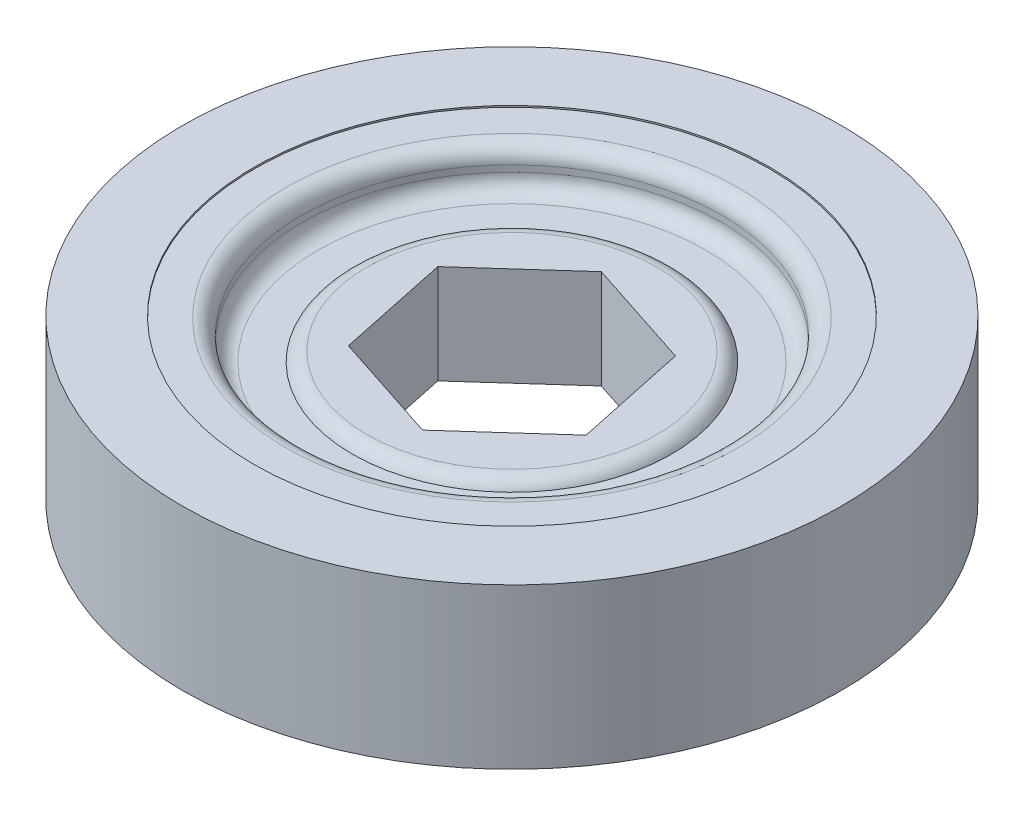
ISO-10303-21;
HEADER;
FILE_DESCRIPTION(('STEP AP214'),'2;1');
FILE_NAME('part.step','',(''),(''),'','','');
FILE_SCHEMA(('AUTOMOTIVE_DESIGN { 1 0 10303 214 1 1 1 1 }'));
ENDSEC;
DATA;
#1=APPLICATION_CONTEXT('core data for automotive mechanical design processes');
#2=APPLICATION_PROTOCOL_DEFINITION('international standard','automotive_design',2000,#1);
#3=PRODUCT_CONTEXT('',#1,'mechanical');
#4=PRODUCT('Part','Part','',(#3));
#5=PRODUCT_RELATED_PRODUCT_CATEGORY('part','',(#4));
#6=PRODUCT_DEFINITION_FORMATION('','',#4);
#7=PRODUCT_DEFINITION_CONTEXT('part definition',#1,'design');
#8=PRODUCT_DEFINITION('design','',#6,#7);
#9=PRODUCT_DEFINITION_SHAPE('','',#8);
#10=(LENGTH_UNIT() NAMED_UNIT(*) SI_UNIT(.MILLI.,.METRE.));
#11=(NAMED_UNIT(*) PLANE_ANGLE_UNIT() SI_UNIT($,.RADIAN.));
#12=(NAMED_UNIT(*) SI_UNIT($,.STERADIAN.) SOLID_ANGLE_UNIT());
#13=UNCERTAINTY_MEASURE_WITH_UNIT(LENGTH_MEASURE(1.E-05),#10,'distance_accuracy_value','');
#14=(GEOMETRIC_REPRESENTATION_CONTEXT(3) GLOBAL_UNCERTAINTY_ASSIGNED_CONTEXT((#13)) GLOBAL_UNIT_ASSIGNED_CONTEXT((#10,
#11,#12)) REPRESENTATION_CONTEXT('',''));
#15=CARTESIAN_POINT('',(0.,0.,0.));
#16=DIRECTION('',(0.,0.,1.));
#17=DIRECTION('',(1.,0.,0.));
#18=AXIS2_PLACEMENT_3D('',#15,#16,#17);
#19=CARTESIAN_POINT('',(-10.31875,3.09999999999991,0.));
#20=DIRECTION('',(0.,1.,0.));
#21=DIRECTION('',(0.,0.,1.));
#22=AXIS2_PLACEMENT_3D('',#19,#20,#21);
#23=CYLINDRICAL_SURFACE('',#22,16.1375);
#24=CARTESIAN_POINT('',(-10.31875,-5.,0.));
#25=DIRECTION('',(0.,1.,0.));
#26=DIRECTION('',(0.,0.,1.));
#27=AXIS2_PLACEMENT_3D('',#24,#25,#26);
#28=CIRCLE('',#27,16.1375);
#29=CARTESIAN_POINT('',(-10.31875,-5.,16.1375));
#30=VERTEX_POINT('',#29);
#31=EDGE_CURVE('E153',#30,#30,#28,.T.);
#32=ORIENTED_EDGE('',*,*,#31,.F.);
#33=EDGE_LOOP('',(#32));
#34=FACE_BOUND('',#33,.T.);
#35=CARTESIAN_POINT('',(-10.31875,-4.9,0.));
#36=DIRECTION('',(0.,1.,0.));
#37=DIRECTION('',(0.,0.,1.));
#38=AXIS2_PLACEMENT_3D('',#35,#36,#37);
#39=CIRCLE('',#38,16.1375);
#40=CARTESIAN_POINT('',(-10.31875,-4.9,16.1375));
#41=VERTEX_POINT('',#40);
#42=EDGE_CURVE('E126',#41,#41,#39,.T.);
#43=ORIENTED_EDGE('',*,*,#42,.T.);
#44=EDGE_LOOP('',(#43));
#45=FACE_BOUND('',#44,.T.);
#46=ADVANCED_FACE('F41',(#34,#45),#23,.F.);
#47=CARTESIAN_POINT('',(10.31875,-5.,0.));
#48=DIRECTION('',(0.,1.,0.));
#49=DIRECTION('',(0.,0.,1.));
#50=AXIS2_PLACEMENT_3D('',#47,#48,#49);
#51=PLANE('',#50);
#52=CARTESIAN_POINT('',(-10.31875,-5.,0.));
#53=DIRECTION('',(0.,1.,0.));
#54=DIRECTION('',(0.,0.,1.));
#55=AXIS2_PLACEMENT_3D('',#52,#53,#54);
#56=CIRCLE('',#55,20.6375);
#57=CARTESIAN_POINT('',(-10.31875,-5.,20.6375));
#58=VERTEX_POINT('',#57);
#59=EDGE_CURVE('E150',#58,#58,#56,.T.);
#60=ORIENTED_EDGE('',*,*,#59,.F.);
#61=EDGE_LOOP('',(#60));
#62=FACE_BOUND('',#61,.T.);
#63=ORIENTED_EDGE('',*,*,#31,.T.);
#64=EDGE_LOOP('',(#63));
#65=FACE_BOUND('',#64,.T.);
#66=ADVANCED_FACE('F210',(#62,#65),#51,.F.);
#67=CARTESIAN_POINT('',(-10.31875,3.09999999999991,0.));
#68=DIRECTION('',(0.,1.,0.));
#69=DIRECTION('',(0.,0.,1.));
#70=AXIS2_PLACEMENT_3D('',#67,#68,#69);
#71=CYLINDRICAL_SURFACE('',#70,20.6375);
#72=CARTESIAN_POINT('',(-10.31875,5.,0.));
#73=DIRECTION('',(0.,1.,0.));
#74=DIRECTION('',(0.,0.,1.));
#75=AXIS2_PLACEMENT_3D('',#72,#73,#74);
#76=CIRCLE('',#75,20.6375);
#77=CARTESIAN_POINT('',(-10.31875,5.,20.6375));
#78=VERTEX_POINT('',#77);
#79=EDGE_CURVE('E147',#78,#78,#76,.T.);
#80=ORIENTED_EDGE('',*,*,#79,.F.);
#81=EDGE_LOOP('',(#80));
#82=FACE_BOUND('',#81,.T.);
#83=ORIENTED_EDGE('',*,*,#59,.T.);
#84=EDGE_LOOP('',(#83));
#85=FACE_BOUND('',#84,.T.);
#86=ADVANCED_FACE('F216',(#82,#85),#71,.T.);
#87=CARTESIAN_POINT('',(10.31875,5.,0.));
#88=DIRECTION('',(0.,-1.,0.));
#89=DIRECTION('',(0.,0.,-1.));
#90=AXIS2_PLACEMENT_3D('',#87,#88,#89);
#91=PLANE('',#90);
#92=CARTESIAN_POINT('',(-10.31875,5.,0.));
#93=DIRECTION('',(0.,1.,0.));
#94=DIRECTION('',(0.,0.,1.));
#95=AXIS2_PLACEMENT_3D('',#92,#93,#94);
#96=CIRCLE('',#95,16.1375);
#97=CARTESIAN_POINT('',(-10.31875,5.,16.1375));
#98=VERTEX_POINT('',#97);
#99=EDGE_CURVE('E144',#98,#98,#96,.T.);
#100=ORIENTED_EDGE('',*,*,#99,.F.);
#101=EDGE_LOOP('',(#100));
#102=FACE_BOUND('',#101,.T.);
#103=ORIENTED_EDGE('',*,*,#79,.T.);
#104=EDGE_LOOP('',(#103));
#105=FACE_BOUND('',#104,.T.);
#106=ADVANCED_FACE('F284',(#102,#105),#91,.F.);
#107=CARTESIAN_POINT('',(-10.31875,3.09999999999991,0.));
#108=DIRECTION('',(0.,1.,0.));
#109=DIRECTION('',(0.,0.,1.));
#110=AXIS2_PLACEMENT_3D('',#107,#108,#109);
#111=CYLINDRICAL_SURFACE('',#110,16.1375);
#112=CARTESIAN_POINT('',(-10.31875,4.9,0.));
#113=DIRECTION('',(0.,1.,0.));
#114=DIRECTION('',(0.,0.,1.));
#115=AXIS2_PLACEMENT_3D('',#112,#113,#114);
#116=CIRCLE('',#115,16.1375);
#117=CARTESIAN_POINT('',(-10.31875,4.9,16.1375));
#118=VERTEX_POINT('',#117);
#119=EDGE_CURVE('E141',#118,#118,#116,.T.);
#120=ORIENTED_EDGE('',*,*,#119,.F.);
#121=EDGE_LOOP('',(#120));
#122=FACE_BOUND('',#121,.T.);
#123=ORIENTED_EDGE('',*,*,#99,.T.);
#124=EDGE_LOOP('',(#123));
#125=FACE_BOUND('',#124,.T.);
#126=ADVANCED_FACE('F280',(#122,#125),#111,.F.);
#127=CARTESIAN_POINT('',(5.81875,4.9,0.));
#128=DIRECTION('',(0.,-1.,0.));
#129=DIRECTION('',(0.,0.,-1.));
#130=AXIS2_PLACEMENT_3D('',#127,#128,#129);
#131=PLANE('',#130);
#132=CARTESIAN_POINT('',(-10.31875,4.9,0.));
#133=DIRECTION('',(0.,-1.,0.));
#134=DIRECTION('',(0.,0.,-1.));
#135=AXIS2_PLACEMENT_3D('',#132,#133,#134);
#136=CIRCLE('',#135,14.1375);
#137=CARTESIAN_POINT('',(-10.31875,4.9,-14.1375));
#138=VERTEX_POINT('',#137);
#139=EDGE_CURVE('E177',#138,#138,#136,.T.);
#140=ORIENTED_EDGE('',*,*,#139,.T.);
#141=EDGE_LOOP('',(#140));
#142=FACE_BOUND('',#141,.T.);
#143=ORIENTED_EDGE('',*,*,#119,.T.);
#144=EDGE_LOOP('',(#143));
#145=FACE_BOUND('',#144,.T.);
#146=ADVANCED_FACE('F276',(#142,#145),#131,.F.);
#147=CARTESIAN_POINT('',(-10.31875,3.09999999999991,0.));
#148=DIRECTION('',(0.,1.,0.));
#149=DIRECTION('',(0.,0.,1.));
#150=AXIS2_PLACEMENT_3D('',#147,#148,#149);
#151=CYLINDRICAL_SURFACE('',#150,13.1375);
#152=CARTESIAN_POINT('',(-10.31875,3.5,0.));
#153=DIRECTION('',(0.,-1.,0.));
#154=DIRECTION('',(0.,0.,-1.));
#155=AXIS2_PLACEMENT_3D('',#152,#153,#154);
#156=CIRCLE('',#155,13.1375);
#157=CARTESIAN_POINT('',(-10.31875,3.5,-13.1375));
#158=VERTEX_POINT('',#157);
#159=EDGE_CURVE('E183',#158,#158,#156,.T.);
#160=ORIENTED_EDGE('',*,*,#159,.T.);
#161=EDGE_LOOP('',(#160));
#162=FACE_BOUND('',#161,.T.);
#163=CARTESIAN_POINT('',(-10.31875,3.9,0.));
#164=DIRECTION('',(0.,-1.,0.));
#165=DIRECTION('',(0.,0.,-1.));
#166=AXIS2_PLACEMENT_3D('',#163,#164,#165);
#167=CIRCLE('',#166,13.1375);
#168=CARTESIAN_POINT('',(-10.31875,3.9,-13.1375));
#169=VERTEX_POINT('',#168);
#170=EDGE_CURVE('E174',#169,#169,#167,.F.);
#171=ORIENTED_EDGE('',*,*,#170,.T.);
#172=EDGE_LOOP('',(#171));
#173=FACE_BOUND('',#172,.T.);
#174=ADVANCED_FACE('F272',(#162,#173),#151,.F.);
#175=CARTESIAN_POINT('',(2.81875,2.5,0.));
#176=DIRECTION('',(0.,-1.,0.));
#177=DIRECTION('',(0.,0.,-1.));
#178=AXIS2_PLACEMENT_3D('',#175,#176,#177);
#179=PLANE('',#178);
#180=CARTESIAN_POINT('',(-10.31875,2.5,0.));
#181=DIRECTION('',(0.,-1.,0.));
#182=DIRECTION('',(0.,0.,-1.));
#183=AXIS2_PLACEMENT_3D('',#180,#181,#182);
#184=CIRCLE('',#183,12.1375);
#185=CARTESIAN_POINT('',(-10.31875,2.5,-12.1375));
#186=VERTEX_POINT('',#185);
#187=EDGE_CURVE('E180',#186,#186,#184,.F.);
#188=ORIENTED_EDGE('',*,*,#187,.T.);
#189=EDGE_LOOP('',(#188));
#190=FACE_BOUND('',#189,.T.);
#191=CARTESIAN_POINT('',(-10.31875,2.5,0.));
#192=DIRECTION('',(0.,1.,0.));
#193=DIRECTION('',(0.,0.,1.));
#194=AXIS2_PLACEMENT_3D('',#191,#192,#193);
#195=CIRCLE('',#194,10.);
#196=CARTESIAN_POINT('',(-10.31875,2.5,10.));
#197=VERTEX_POINT('',#196);
#198=EDGE_CURVE('E138',#197,#197,#195,.T.);
#199=ORIENTED_EDGE('',*,*,#198,.F.);
#200=EDGE_LOOP('',(#199));
#201=FACE_BOUND('',#200,.T.);
#202=ADVANCED_FACE('F268',(#190,#201),#179,.F.);
#203=CARTESIAN_POINT('',(-0.318749999999998,3.09999999999991,0.));
#204=DIRECTION('',(0.,-1.,0.));
#205=DIRECTION('',(0.,0.,-1.));
#206=AXIS2_PLACEMENT_3D('',#203,#204,#205);
#207=PLANE('',#206);
#208=CARTESIAN_POINT('',(-10.31875,3.09999999999991,0.));
#209=DIRECTION('',(0.,-1.,0.));
#210=DIRECTION('',(0.,0.,-1.));
#211=AXIS2_PLACEMENT_3D('',#208,#209,#210);
#212=CIRCLE('',#211,9.08348486100887);
#213=CARTESIAN_POINT('',(-10.31875,3.09999999999991,-9.08348486100887));
#214=VERTEX_POINT('',#213);
#215=EDGE_CURVE('E171',#214,#214,#212,.F.);
#216=ORIENTED_EDGE('',*,*,#215,.T.);
#217=EDGE_LOOP('',(#216));
#218=FACE_BOUND('',#217,.T.);
#219=DIRECTION('',(0.206704462982249,0.,0.978403426498098));
#220=VECTOR('',#219,1.);
#221=CARTESIAN_POINT('',(-17.2111397914146,3.0999999999999,-2.24888037992331));
#222=LINE('',#221,#220);
#223=CARTESIAN_POINT('',(-17.2111397914146,3.09999999999991,-2.24888037992331));
#224=VERTEX_POINT('',#223);
#225=CARTESIAN_POINT('',(-15.7125324347933,3.09999999999991,4.8445444621879));
#226=VERTEX_POINT('',#225);
#227=EDGE_CURVE('E106',#224,#226,#222,.T.);
#228=ORIENTED_EDGE('',*,*,#227,.F.);
#229=DIRECTION('',(-0.743969991005969,0.,0.668213029267297));
#230=VECTOR('',#229,1.);
#231=CARTESIAN_POINT('',(-11.8173573566213,3.09999999999991,-7.09342484211121));
#232=LINE('',#231,#230);
#233=CARTESIAN_POINT('',(-11.8173573566213,3.09999999999991,-7.09342484211121));
#234=VERTEX_POINT('',#233);
#235=EDGE_CURVE('E56',#234,#224,#232,.T.);
#236=ORIENTED_EDGE('',*,*,#235,.F.);
#237=DIRECTION('',(-0.950674453988218,0.,-0.310190397230802));
#238=VECTOR('',#237,1.);
#239=CARTESIAN_POINT('',(-4.92496756520672,3.09999999999991,-4.8445444621879));
#240=LINE('',#239,#238);
#241=CARTESIAN_POINT('',(-4.92496756520672,3.09999999999991,-4.8445444621879));
#242=VERTEX_POINT('',#241);
#243=EDGE_CURVE('E121',#242,#234,#240,.T.);
#244=ORIENTED_EDGE('',*,*,#243,.F.);
#245=DIRECTION('',(-0.206704462982249,0.,-0.978403426498099));
#246=VECTOR('',#245,1.);
#247=CARTESIAN_POINT('',(-3.42636020858542,3.09999999999991,2.24888037992331));
#248=LINE('',#247,#246);
#249=CARTESIAN_POINT('',(-3.42636020858542,3.09999999999991,2.24888037992331));
#250=VERTEX_POINT('',#249);
#251=EDGE_CURVE('E115',#250,#242,#248,.T.);
#252=ORIENTED_EDGE('',*,*,#251,.F.);
#253=DIRECTION('',(0.743969991005969,0.,-0.668213029267297));
#254=VECTOR('',#253,1.);
#255=CARTESIAN_POINT('',(-8.82014264337869,3.09999999999991,7.09342484211121));
#256=LINE('',#255,#254);
#257=CARTESIAN_POINT('',(-8.82014264337869,3.09999999999991,7.09342484211121));
#258=VERTEX_POINT('',#257);
#259=EDGE_CURVE('E113',#258,#250,#256,.T.);
#260=ORIENTED_EDGE('',*,*,#259,.F.);
#261=DIRECTION('',(0.950674453988219,0.,0.310190397230801));
#262=VECTOR('',#261,1.);
#263=CARTESIAN_POINT('',(-15.7125324347933,3.09999999999991,4.8445444621879));
#264=LINE('',#263,#262);
#265=EDGE_CURVE('E97',#226,#258,#264,.T.);
#266=ORIENTED_EDGE('',*,*,#265,.F.);
#267=EDGE_LOOP('',(#228,#236,#244,#252,#260,#266));
#268=FACE_BOUND('',#267,.T.);
#269=ADVANCED_FACE('F110',(#218,#268),#207,.F.);
#270=CARTESIAN_POINT('',(-0.318749999999998,-3.09999999999991,0.));
#271=DIRECTION('',(0.,1.,0.));
#272=DIRECTION('',(0.,0.,1.));
#273=AXIS2_PLACEMENT_3D('',#270,#271,#272);
#274=PLANE('',#273);
#275=DIRECTION('',(-0.950674453988219,0.,-0.310190397230802));
#276=VECTOR('',#275,1.);
#277=CARTESIAN_POINT('',(0.666656713743965,-3.09999999999991,-3.02008378695175));
#278=LINE('',#277,#276);
#279=CARTESIAN_POINT('',(-4.92496756520672,-3.09999999999991,-4.8445444621879));
#280=VERTEX_POINT('',#279);
#281=CARTESIAN_POINT('',(-11.8173573566213,-3.09999999999991,-7.09342484211121));
#282=VERTEX_POINT('',#281);
#283=EDGE_CURVE('E165',#280,#282,#278,.T.);
#284=ORIENTED_EDGE('',*,*,#283,.T.);
#285=DIRECTION('',(-0.743969991005969,0.,0.668213029267297));
#286=VECTOR('',#285,1.);
#287=CARTESIAN_POINT('',(-8.97933509884372,-3.09999999999991,-9.64245702475789));
#288=LINE('',#287,#286);
#289=CARTESIAN_POINT('',(-17.2111397914146,-3.09999999999991,-2.24888037992331));
#290=VERTEX_POINT('',#289);
#291=EDGE_CURVE('E168',#282,#290,#288,.T.);
#292=ORIENTED_EDGE('',*,*,#291,.T.);
#293=DIRECTION('',(0.206704462982249,0.,0.978403426498099));
#294=VECTOR('',#293,1.);
#295=CARTESIAN_POINT('',(-16.0345687629361,-3.09999999999991,3.32023558967512));
#296=LINE('',#295,#294);
#297=CARTESIAN_POINT('',(-15.7125324347933,-3.09999999999991,4.8445444621879));
#298=VERTEX_POINT('',#297);
#299=EDGE_CURVE('E156',#290,#298,#296,.T.);
#300=ORIENTED_EDGE('',*,*,#299,.T.);
#301=DIRECTION('',(0.950674453988219,0.,0.310190397230801));
#302=VECTOR('',#301,1.);
#303=CARTESIAN_POINT('',(-3.22851836442801,-3.09999999999991,8.91788551734736));
#304=LINE('',#303,#302);
#305=CARTESIAN_POINT('',(-8.82014264337869,-3.09999999999991,7.09342484211121));
#306=VERTEX_POINT('',#305);
#307=EDGE_CURVE('E100',#298,#306,#304,.T.);
#308=ORIENTED_EDGE('',*,*,#307,.T.);
#309=DIRECTION('',(0.743969991005969,0.,-0.668213029267298));
#310=VECTOR('',#309,1.);
#311=CARTESIAN_POINT('',(-0.588337950807832,-3.09999999999991,-0.300151802723368));
#312=LINE('',#311,#310);
#313=CARTESIAN_POINT('',(-3.42636020858541,-3.09999999999991,2.24888037992331));
#314=VERTEX_POINT('',#313);
#315=EDGE_CURVE('E159',#306,#314,#312,.T.);
#316=ORIENTED_EDGE('',*,*,#315,.T.);
#317=DIRECTION('',(-0.206704462982249,0.,-0.978403426498099));
#318=VECTOR('',#317,1.);
#319=CARTESIAN_POINT('',(-3.74839653672827,-3.09999999999991,0.724571507410522));
#320=LINE('',#319,#318);
#321=EDGE_CURVE('E162',#314,#280,#320,.T.);
#322=ORIENTED_EDGE('',*,*,#321,.T.);
#323=EDGE_LOOP('',(#284,#292,#300,#308,#316,#322));
#324=FACE_BOUND('',#323,.T.);
#325=CARTESIAN_POINT('',(-10.31875,-3.09999999999991,0.));
#326=DIRECTION('',(0.,1.,0.));
#327=DIRECTION('',(0.,0.,1.));
#328=AXIS2_PLACEMENT_3D('',#325,#326,#327);
#329=CIRCLE('',#328,10.);
#330=CARTESIAN_POINT('',(-10.31875,-3.09999999999991,10.));
#331=VERTEX_POINT('',#330);
#332=EDGE_CURVE('E135',#331,#331,#329,.T.);
#333=ORIENTED_EDGE('',*,*,#332,.F.);
#334=EDGE_LOOP('',(#333));
#335=FACE_BOUND('',#334,.T.);
#336=ADVANCED_FACE('F247',(#324,#335),#274,.F.);
#337=CARTESIAN_POINT('',(2.81875,-2.5,0.));
#338=DIRECTION('',(0.,1.,0.));
#339=DIRECTION('',(0.,0.,1.));
#340=AXIS2_PLACEMENT_3D('',#337,#338,#339);
#341=PLANE('',#340);
#342=CARTESIAN_POINT('',(-10.31875,-2.5,0.));
#343=DIRECTION('',(0.,1.,0.));
#344=DIRECTION('',(0.,0.,1.));
#345=AXIS2_PLACEMENT_3D('',#342,#343,#344);
#346=CIRCLE('',#345,10.9165151389911);
#347=CARTESIAN_POINT('',(-10.31875,-2.5,10.9165151389911));
#348=VERTEX_POINT('',#347);
#349=EDGE_CURVE('E189',#348,#348,#346,.T.);
#350=ORIENTED_EDGE('',*,*,#349,.T.);
#351=EDGE_LOOP('',(#350));
#352=FACE_BOUND('',#351,.T.);
#353=CARTESIAN_POINT('',(-10.31875,-2.5,0.));
#354=DIRECTION('',(0.,1.,0.));
#355=DIRECTION('',(0.,0.,1.));
#356=AXIS2_PLACEMENT_3D('',#353,#354,#355);
#357=CIRCLE('',#356,12.1375);
#358=CARTESIAN_POINT('',(-10.31875,-2.5,12.1375));
#359=VERTEX_POINT('',#358);
#360=EDGE_CURVE('E186',#359,#359,#357,.F.);
#361=ORIENTED_EDGE('',*,*,#360,.T.);
#362=EDGE_LOOP('',(#361));
#363=FACE_BOUND('',#362,.T.);
#364=ADVANCED_FACE('F243',(#352,#363),#341,.F.);
#365=CARTESIAN_POINT('',(-10.31875,3.09999999999991,0.));
#366=DIRECTION('',(0.,1.,0.));
#367=DIRECTION('',(0.,0.,1.));
#368=AXIS2_PLACEMENT_3D('',#365,#366,#367);
#369=CYLINDRICAL_SURFACE('',#368,13.1375);
#370=CARTESIAN_POINT('',(-10.31875,-3.9,0.));
#371=DIRECTION('',(0.,1.,0.));
#372=DIRECTION('',(0.,0.,1.));
#373=AXIS2_PLACEMENT_3D('',#370,#371,#372);
#374=CIRCLE('',#373,13.1375);
#375=CARTESIAN_POINT('',(-10.31875,-3.9,13.1375));
#376=VERTEX_POINT('',#375);
#377=EDGE_CURVE('E11',#376,#376,#374,.F.);
#378=ORIENTED_EDGE('',*,*,#377,.T.);
#379=EDGE_LOOP('',(#378));
#380=FACE_BOUND('',#379,.T.);
#381=CARTESIAN_POINT('',(-10.31875,-3.5,0.));
#382=DIRECTION('',(0.,1.,0.));
#383=DIRECTION('',(0.,0.,1.));
#384=AXIS2_PLACEMENT_3D('',#381,#382,#383);
#385=CIRCLE('',#384,13.1375);
#386=CARTESIAN_POINT('',(-10.31875,-3.5,13.1375));
#387=VERTEX_POINT('',#386);
#388=EDGE_CURVE('E192',#387,#387,#385,.T.);
#389=ORIENTED_EDGE('',*,*,#388,.T.);
#390=EDGE_LOOP('',(#389));
#391=FACE_BOUND('',#390,.T.);
#392=ADVANCED_FACE('F246',(#380,#391),#369,.F.);
#393=CARTESIAN_POINT('',(5.81875,-4.9,0.));
#394=DIRECTION('',(0.,1.,0.));
#395=DIRECTION('',(0.,0.,1.));
#396=AXIS2_PLACEMENT_3D('',#393,#394,#395);
#397=PLANE('',#396);
#398=CARTESIAN_POINT('',(-10.31875,-4.9,0.));
#399=DIRECTION('',(0.,1.,0.));
#400=DIRECTION('',(0.,0.,1.));
#401=AXIS2_PLACEMENT_3D('',#398,#399,#400);
#402=CIRCLE('',#401,14.1375);
#403=CARTESIAN_POINT('',(-10.31875,-4.9,14.1375));
#404=VERTEX_POINT('',#403);
#405=EDGE_CURVE('E49',#404,#404,#402,.T.);
#406=ORIENTED_EDGE('',*,*,#405,.T.);
#407=EDGE_LOOP('',(#406));
#408=FACE_BOUND('',#407,.T.);
#409=ORIENTED_EDGE('',*,*,#42,.F.);
#410=EDGE_LOOP('',(#409));
#411=FACE_BOUND('',#410,.T.);
#412=ADVANCED_FACE('F197',(#408,#411),#397,.F.);
#413=CARTESIAN_POINT('',(-11.8173573566213,-5.00000000000001,-7.09342484211121));
#414=DIRECTION('',(-0.668213029267297,0.,-0.743969991005969));
#415=DIRECTION('',(-0.743969991005969,0.,0.668213029267297));
#416=AXIS2_PLACEMENT_3D('',#413,#414,#415);
#417=PLANE('',#416);
#418=DIRECTION('',(0.,1.,0.));
#419=VECTOR('',#418,1.);
#420=CARTESIAN_POINT('',(-11.8173573566213,-5.00000000000001,-7.09342484211121));
#421=LINE('',#420,#419);
#422=EDGE_CURVE('E124',#282,#234,#421,.T.);
#423=ORIENTED_EDGE('',*,*,#422,.T.);
#424=ORIENTED_EDGE('',*,*,#235,.T.);
#425=DIRECTION('',(0.,1.,0.));
#426=VECTOR('',#425,1.);
#427=CARTESIAN_POINT('',(-17.2111397914146,-5.00000000000001,-2.24888037992331));
#428=LINE('',#427,#426);
#429=EDGE_CURVE('E103',#290,#224,#428,.T.);
#430=ORIENTED_EDGE('',*,*,#429,.F.);
#431=ORIENTED_EDGE('',*,*,#291,.F.);
#432=EDGE_LOOP('',(#423,#424,#430,#431));
#433=FACE_BOUND('',#432,.T.);
#434=ADVANCED_FACE('F259',(#433),#417,.F.);
#435=CARTESIAN_POINT('',(-4.92496756520672,-5.00000000000001,-4.8445444621879));
#436=DIRECTION('',(0.310190397230802,0.,-0.950674453988218));
#437=DIRECTION('',(-0.950674453988219,0.,-0.310190397230802));
#438=AXIS2_PLACEMENT_3D('',#435,#436,#437);
#439=PLANE('',#438);
#440=DIRECTION('',(0.,1.,0.));
#441=VECTOR('',#440,1.);
#442=CARTESIAN_POINT('',(-4.92496756520672,-5.00000000000001,-4.8445444621879));
#443=LINE('',#442,#441);
#444=EDGE_CURVE('E127',#280,#242,#443,.T.);
#445=ORIENTED_EDGE('',*,*,#444,.T.);
#446=ORIENTED_EDGE('',*,*,#243,.T.);
#447=ORIENTED_EDGE('',*,*,#422,.F.);
#448=ORIENTED_EDGE('',*,*,#283,.F.);
#449=EDGE_LOOP('',(#445,#446,#447,#448));
#450=FACE_BOUND('',#449,.T.);
#451=ADVANCED_FACE('F383',(#450),#439,.F.);
#452=CARTESIAN_POINT('',(-3.42636020858541,-5.00000000000001,2.24888037992331));
#453=DIRECTION('',(0.978403426498098,0.,-0.206704462982249));
#454=DIRECTION('',(-0.206704462982249,0.,-0.978403426498099));
#455=AXIS2_PLACEMENT_3D('',#452,#453,#454);
#456=PLANE('',#455);
#457=DIRECTION('',(0.,1.,0.));
#458=VECTOR('',#457,1.);
#459=CARTESIAN_POINT('',(-3.42636020858541,-5.00000000000001,2.24888037992331));
#460=LINE('',#459,#458);
#461=EDGE_CURVE('E129',#314,#250,#460,.T.);
#462=ORIENTED_EDGE('',*,*,#461,.T.);
#463=ORIENTED_EDGE('',*,*,#251,.T.);
#464=ORIENTED_EDGE('',*,*,#444,.F.);
#465=ORIENTED_EDGE('',*,*,#321,.F.);
#466=EDGE_LOOP('',(#462,#463,#464,#465));
#467=FACE_BOUND('',#466,.T.);
#468=ADVANCED_FACE('F390',(#467),#456,.F.);
#469=CARTESIAN_POINT('',(-8.82014264337869,-5.00000000000001,7.09342484211121));
#470=DIRECTION('',(0.668213029267297,0.,0.743969991005969));
#471=DIRECTION('',(0.743969991005969,0.,-0.668213029267298));
#472=AXIS2_PLACEMENT_3D('',#469,#470,#471);
#473=PLANE('',#472);
#474=DIRECTION('',(0.,1.,0.));
#475=VECTOR('',#474,1.);
#476=CARTESIAN_POINT('',(-8.82014264337869,-5.00000000000001,7.09342484211121));
#477=LINE('',#476,#475);
#478=EDGE_CURVE('E102',#306,#258,#477,.T.);
#479=ORIENTED_EDGE('',*,*,#478,.T.);
#480=ORIENTED_EDGE('',*,*,#259,.T.);
#481=ORIENTED_EDGE('',*,*,#461,.F.);
#482=ORIENTED_EDGE('',*,*,#315,.F.);
#483=EDGE_LOOP('',(#479,#480,#481,#482));
#484=FACE_BOUND('',#483,.T.);
#485=ADVANCED_FACE('F398',(#484),#473,.F.);
#486=CARTESIAN_POINT('',(-15.7125324347933,-5.00000000000001,4.8445444621879));
#487=DIRECTION('',(-0.310190397230801,0.,0.950674453988219));
#488=DIRECTION('',(0.950674453988219,0.,0.310190397230801));
#489=AXIS2_PLACEMENT_3D('',#486,#487,#488);
#490=PLANE('',#489);
#491=DIRECTION('',(0.,1.,0.));
#492=VECTOR('',#491,1.);
#493=CARTESIAN_POINT('',(-15.7125324347933,-5.00000000000001,4.8445444621879));
#494=LINE('',#493,#492);
#495=EDGE_CURVE('E64',#298,#226,#494,.T.);
#496=ORIENTED_EDGE('',*,*,#495,.T.);
#497=ORIENTED_EDGE('',*,*,#265,.T.);
#498=ORIENTED_EDGE('',*,*,#478,.F.);
#499=ORIENTED_EDGE('',*,*,#307,.F.);
#500=EDGE_LOOP('',(#496,#497,#498,#499));
#501=FACE_BOUND('',#500,.T.);
#502=ADVANCED_FACE('F94',(#501),#490,.F.);
#503=CARTESIAN_POINT('',(-17.2111397914146,-5.00000000000001,-2.24888037992331));
#504=DIRECTION('',(-0.978403426498098,0.,0.206704462982249));
#505=DIRECTION('',(0.206704462982249,0.,0.978403426498099));
#506=AXIS2_PLACEMENT_3D('',#503,#504,#505);
#507=PLANE('',#506);
#508=ORIENTED_EDGE('',*,*,#429,.T.);
#509=ORIENTED_EDGE('',*,*,#227,.T.);
#510=ORIENTED_EDGE('',*,*,#495,.F.);
#511=ORIENTED_EDGE('',*,*,#299,.F.);
#512=EDGE_LOOP('',(#508,#509,#510,#511));
#513=FACE_BOUND('',#512,.T.);
#514=ADVANCED_FACE('F107',(#513),#507,.F.);
#515=CARTESIAN_POINT('',(-10.31875,2.09999999999991,0.));
#516=DIRECTION('',(0.,1.,0.));
#517=DIRECTION('',(0.,0.,1.));
#518=AXIS2_PLACEMENT_3D('',#515,#516,#517);
#519=TOROIDAL_SURFACE('',#518,9.08348486100887,1.);
#520=ORIENTED_EDGE('',*,*,#198,.T.);
#521=EDGE_LOOP('',(#520));
#522=FACE_BOUND('',#521,.T.);
#523=ORIENTED_EDGE('',*,*,#215,.F.);
#524=EDGE_LOOP('',(#523));
#525=FACE_BOUND('',#524,.T.);
#526=ADVANCED_FACE('F223',(#522,#525),#519,.T.);
#527=CARTESIAN_POINT('',(-10.31875,3.9,0.));
#528=DIRECTION('',(0.,-1.,0.));
#529=DIRECTION('',(0.,0.,-1.));
#530=AXIS2_PLACEMENT_3D('',#527,#528,#529);
#531=TOROIDAL_SURFACE('',#530,14.1375,1.);
#532=ORIENTED_EDGE('',*,*,#139,.F.);
#533=EDGE_LOOP('',(#532));
#534=FACE_BOUND('',#533,.T.);
#535=ORIENTED_EDGE('',*,*,#170,.F.);
#536=EDGE_LOOP('',(#535));
#537=FACE_BOUND('',#536,.T.);
#538=ADVANCED_FACE('F226',(#534,#537),#531,.T.);
#539=CARTESIAN_POINT('',(-10.31875,3.5,0.));
#540=DIRECTION('',(0.,-1.,0.));
#541=DIRECTION('',(0.,0.,-1.));
#542=AXIS2_PLACEMENT_3D('',#539,#540,#541);
#543=TOROIDAL_SURFACE('',#542,12.1375,1.);
#544=ORIENTED_EDGE('',*,*,#159,.F.);
#545=EDGE_LOOP('',(#544));
#546=FACE_BOUND('',#545,.T.);
#547=ORIENTED_EDGE('',*,*,#187,.F.);
#548=EDGE_LOOP('',(#547));
#549=FACE_BOUND('',#548,.T.);
#550=ADVANCED_FACE('F230',(#546,#549),#543,.F.);
#551=CARTESIAN_POINT('',(-10.31875,-3.5,0.));
#552=DIRECTION('',(0.,1.,0.));
#553=DIRECTION('',(0.,0.,1.));
#554=AXIS2_PLACEMENT_3D('',#551,#552,#553);
#555=TOROIDAL_SURFACE('',#554,10.9165151389911,1.);
#556=ORIENTED_EDGE('',*,*,#332,.T.);
#557=EDGE_LOOP('',(#556));
#558=FACE_BOUND('',#557,.T.);
#559=ORIENTED_EDGE('',*,*,#349,.F.);
#560=EDGE_LOOP('',(#559));
#561=FACE_BOUND('',#560,.T.);
#562=ADVANCED_FACE('F206',(#558,#561),#555,.F.);
#563=CARTESIAN_POINT('',(-10.31875,-3.5,0.));
#564=DIRECTION('',(0.,1.,0.));
#565=DIRECTION('',(0.,0.,1.));
#566=AXIS2_PLACEMENT_3D('',#563,#564,#565);
#567=TOROIDAL_SURFACE('',#566,12.1375,1.);
#568=ORIENTED_EDGE('',*,*,#360,.F.);
#569=EDGE_LOOP('',(#568));
#570=FACE_BOUND('',#569,.T.);
#571=ORIENTED_EDGE('',*,*,#388,.F.);
#572=EDGE_LOOP('',(#571));
#573=FACE_BOUND('',#572,.T.);
#574=ADVANCED_FACE('F201',(#570,#573),#567,.F.);
#575=CARTESIAN_POINT('',(-10.31875,-3.9,0.));
#576=DIRECTION('',(0.,1.,0.));
#577=DIRECTION('',(0.,0.,1.));
#578=AXIS2_PLACEMENT_3D('',#575,#576,#577);
#579=TOROIDAL_SURFACE('',#578,14.1375,1.);
#580=ORIENTED_EDGE('',*,*,#377,.F.);
#581=EDGE_LOOP('',(#580));
#582=FACE_BOUND('',#581,.T.);
#583=ORIENTED_EDGE('',*,*,#405,.F.);
#584=EDGE_LOOP('',(#583));
#585=FACE_BOUND('',#584,.T.);
#586=ADVANCED_FACE('F43',(#582,#585),#579,.T.);
#587=CLOSED_SHELL('',(#46,#66,#86,#106,#126,#146,#174,#202,#269,#336,#364,#392,#412,#434,#451,
#468,#485,#502,#514,#526,#538,#550,#562,#574,#586));
#588=MANIFOLD_SOLID_BREP('B2',#587);
#589=ADVANCED_BREP_SHAPE_REPRESENTATION('',(#18,#588),#14);
#590=SHAPE_DEFINITION_REPRESENTATION(#9,#589);
ENDSEC;
END-ISO-10303-21;
